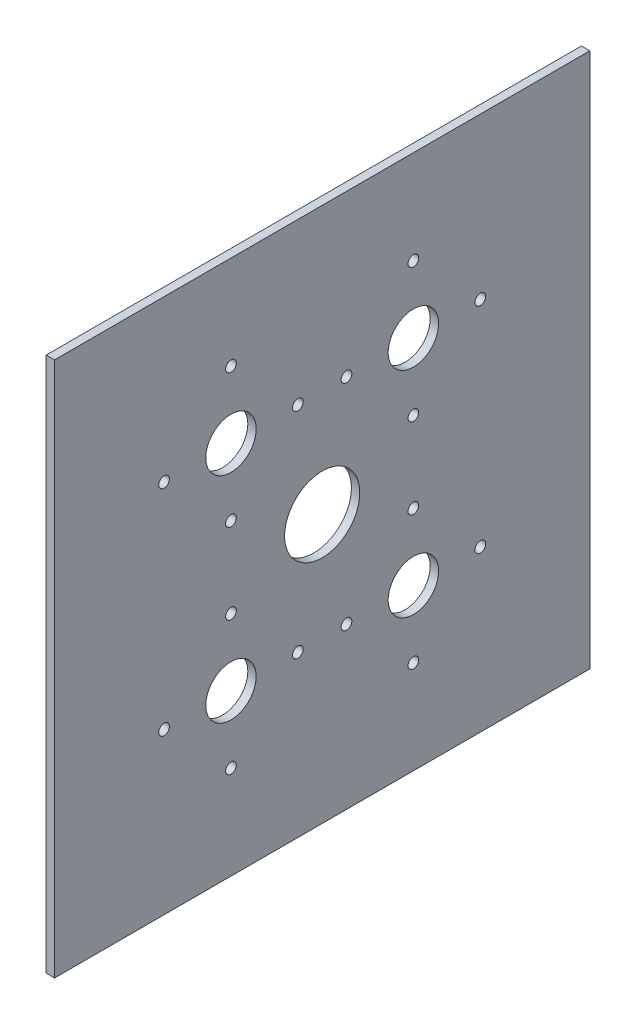
ISO-10303-21;
HEADER;
FILE_DESCRIPTION(('STEP AP214'),'2;1');
FILE_NAME('part.step','',(''),(''),'','','');
FILE_SCHEMA(('AUTOMOTIVE_DESIGN { 1 0 10303 214 1 1 1 1 }'));
ENDSEC;
DATA;
#1=APPLICATION_CONTEXT('core data for automotive mechanical design processes');
#2=APPLICATION_PROTOCOL_DEFINITION('international standard','automotive_design',2000,#1);
#3=PRODUCT_CONTEXT('',#1,'mechanical');
#4=PRODUCT('Part','Part','',(#3));
#5=PRODUCT_RELATED_PRODUCT_CATEGORY('part','',(#4));
#6=PRODUCT_DEFINITION_FORMATION('','',#4);
#7=PRODUCT_DEFINITION_CONTEXT('part definition',#1,'design');
#8=PRODUCT_DEFINITION('design','',#6,#7);
#9=PRODUCT_DEFINITION_SHAPE('','',#8);
#10=(LENGTH_UNIT() NAMED_UNIT(*) SI_UNIT(.MILLI.,.METRE.));
#11=(NAMED_UNIT(*) PLANE_ANGLE_UNIT() SI_UNIT($,.RADIAN.));
#12=(NAMED_UNIT(*) SI_UNIT($,.STERADIAN.) SOLID_ANGLE_UNIT());
#13=UNCERTAINTY_MEASURE_WITH_UNIT(LENGTH_MEASURE(1.E-05),#10,'distance_accuracy_value','');
#14=(GEOMETRIC_REPRESENTATION_CONTEXT(3) GLOBAL_UNCERTAINTY_ASSIGNED_CONTEXT((#13)) GLOBAL_UNIT_ASSIGNED_CONTEXT((#10,
#11,#12)) REPRESENTATION_CONTEXT('',''));
#15=CARTESIAN_POINT('',(0.,0.,0.));
#16=DIRECTION('',(0.,0.,1.));
#17=DIRECTION('',(1.,0.,0.));
#18=AXIS2_PLACEMENT_3D('',#15,#16,#17);
#19=CARTESIAN_POINT('',(-3.175,101.6,101.6));
#20=DIRECTION('',(0.,0.,1.));
#21=DIRECTION('',(0.,-1.,0.));
#22=AXIS2_PLACEMENT_3D('',#19,#20,#21);
#23=PLANE('',#22);
#24=DIRECTION('',(0.,-1.,0.));
#25=VECTOR('',#24,1.);
#26=CARTESIAN_POINT('',(0.,101.6,101.6));
#27=LINE('',#26,#25);
#28=CARTESIAN_POINT('',(0.,101.6,101.6));
#29=VERTEX_POINT('',#28);
#30=CARTESIAN_POINT('',(0.,-101.6,101.6));
#31=VERTEX_POINT('',#30);
#32=EDGE_CURVE('E111',#29,#31,#27,.T.);
#33=ORIENTED_EDGE('',*,*,#32,.F.);
#34=DIRECTION('',(1.,0.,0.));
#35=VECTOR('',#34,1.);
#36=CARTESIAN_POINT('',(-3.175,101.6,101.6));
#37=LINE('',#36,#35);
#38=CARTESIAN_POINT('',(-3.175,101.6,101.6));
#39=VERTEX_POINT('',#38);
#40=EDGE_CURVE('E11',#39,#29,#37,.T.);
#41=ORIENTED_EDGE('',*,*,#40,.F.);
#42=DIRECTION('',(0.,-1.,0.));
#43=VECTOR('',#42,1.);
#44=CARTESIAN_POINT('',(-3.175,101.6,101.6));
#45=LINE('',#44,#43);
#46=CARTESIAN_POINT('',(-3.175,-101.6,101.6));
#47=VERTEX_POINT('',#46);
#48=EDGE_CURVE('E102',#39,#47,#45,.T.);
#49=ORIENTED_EDGE('',*,*,#48,.T.);
#50=DIRECTION('',(1.,0.,0.));
#51=VECTOR('',#50,1.);
#52=CARTESIAN_POINT('',(-3.175,-101.6,101.6));
#53=LINE('',#52,#51);
#54=EDGE_CURVE('E46',#47,#31,#53,.T.);
#55=ORIENTED_EDGE('',*,*,#54,.T.);
#56=EDGE_LOOP('',(#33,#41,#49,#55));
#57=FACE_BOUND('',#56,.T.);
#58=ADVANCED_FACE('F43',(#57),#23,.T.);
#59=CARTESIAN_POINT('',(-3.175,101.6,-101.6));
#60=DIRECTION('',(0.,1.,0.));
#61=DIRECTION('',(0.,0.,1.));
#62=AXIS2_PLACEMENT_3D('',#59,#60,#61);
#63=PLANE('',#62);
#64=DIRECTION('',(0.,0.,1.));
#65=VECTOR('',#64,1.);
#66=CARTESIAN_POINT('',(0.,101.6,-101.6));
#67=LINE('',#66,#65);
#68=CARTESIAN_POINT('',(0.,101.6,-101.6));
#69=VERTEX_POINT('',#68);
#70=EDGE_CURVE('E106',#69,#29,#67,.T.);
#71=ORIENTED_EDGE('',*,*,#70,.F.);
#72=DIRECTION('',(1.,0.,0.));
#73=VECTOR('',#72,1.);
#74=CARTESIAN_POINT('',(-3.175,101.6,-101.6));
#75=LINE('',#74,#73);
#76=CARTESIAN_POINT('',(-3.175,101.6,-101.6));
#77=VERTEX_POINT('',#76);
#78=EDGE_CURVE('E52',#77,#69,#75,.T.);
#79=ORIENTED_EDGE('',*,*,#78,.F.);
#80=DIRECTION('',(0.,0.,1.));
#81=VECTOR('',#80,1.);
#82=CARTESIAN_POINT('',(-3.175,101.6,-101.6));
#83=LINE('',#82,#81);
#84=EDGE_CURVE('E98',#77,#39,#83,.T.);
#85=ORIENTED_EDGE('',*,*,#84,.T.);
#86=ORIENTED_EDGE('',*,*,#40,.T.);
#87=EDGE_LOOP('',(#71,#79,#85,#86));
#88=FACE_BOUND('',#87,.T.);
#89=ADVANCED_FACE('F122',(#88),#63,.T.);
#90=CARTESIAN_POINT('',(-3.175,101.6,-101.6));
#91=DIRECTION('',(0.,0.,-1.));
#92=DIRECTION('',(0.,1.,0.));
#93=AXIS2_PLACEMENT_3D('',#90,#91,#92);
#94=PLANE('',#93);
#95=DIRECTION('',(0.,1.,0.));
#96=VECTOR('',#95,1.);
#97=CARTESIAN_POINT('',(0.,101.6,-101.6));
#98=LINE('',#97,#96);
#99=CARTESIAN_POINT('',(0.,-101.6,-101.6));
#100=VERTEX_POINT('',#99);
#101=EDGE_CURVE('E93',#100,#69,#98,.T.);
#102=ORIENTED_EDGE('',*,*,#101,.F.);
#103=DIRECTION('',(1.,0.,0.));
#104=VECTOR('',#103,1.);
#105=CARTESIAN_POINT('',(-3.175,-101.6,-101.6));
#106=LINE('',#105,#104);
#107=CARTESIAN_POINT('',(-3.175,-101.6,-101.6));
#108=VERTEX_POINT('',#107);
#109=EDGE_CURVE('E88',#108,#100,#106,.T.);
#110=ORIENTED_EDGE('',*,*,#109,.F.);
#111=DIRECTION('',(0.,1.,0.));
#112=VECTOR('',#111,1.);
#113=CARTESIAN_POINT('',(-3.175,101.6,-101.6));
#114=LINE('',#113,#112);
#115=EDGE_CURVE('E91',#108,#77,#114,.T.);
#116=ORIENTED_EDGE('',*,*,#115,.T.);
#117=ORIENTED_EDGE('',*,*,#78,.T.);
#118=EDGE_LOOP('',(#102,#110,#116,#117));
#119=FACE_BOUND('',#118,.T.);
#120=ADVANCED_FACE('F90',(#119),#94,.T.);
#121=CARTESIAN_POINT('',(-3.175,-101.6,-101.6));
#122=DIRECTION('',(0.,-1.,0.));
#123=DIRECTION('',(0.,0.,-1.));
#124=AXIS2_PLACEMENT_3D('',#121,#122,#123);
#125=PLANE('',#124);
#126=DIRECTION('',(0.,0.,-1.));
#127=VECTOR('',#126,1.);
#128=CARTESIAN_POINT('',(0.,-101.6,-101.6));
#129=LINE('',#128,#127);
#130=EDGE_CURVE('E114',#31,#100,#129,.T.);
#131=ORIENTED_EDGE('',*,*,#130,.F.);
#132=ORIENTED_EDGE('',*,*,#54,.F.);
#133=DIRECTION('',(0.,0.,-1.));
#134=VECTOR('',#133,1.);
#135=CARTESIAN_POINT('',(-3.175,-101.6,-101.6));
#136=LINE('',#135,#134);
#137=EDGE_CURVE('E97',#47,#108,#136,.T.);
#138=ORIENTED_EDGE('',*,*,#137,.T.);
#139=ORIENTED_EDGE('',*,*,#109,.T.);
#140=EDGE_LOOP('',(#131,#132,#138,#139));
#141=FACE_BOUND('',#140,.T.);
#142=ADVANCED_FACE('F100',(#141),#125,.T.);
#143=CARTESIAN_POINT('',(-3.175,0.,0.));
#144=DIRECTION('',(-1.,0.,0.));
#145=DIRECTION('',(0.,0.,1.));
#146=AXIS2_PLACEMENT_3D('',#143,#144,#145);
#147=PLANE('',#146);
#148=CARTESIAN_POINT('',(-3.175,-15.2769774160487,-34.6218706995197));
#149=DIRECTION('',(1.,0.,0.));
#150=DIRECTION('',(0.,0.,-1.));
#151=AXIS2_PLACEMENT_3D('',#148,#149,#150);
#152=CIRCLE('',#151,2.032);
#153=CARTESIAN_POINT('',(-3.175,-15.2769774160487,-36.6538706995197));
#154=VERTEX_POINT('',#153);
#155=EDGE_CURVE('E274',#154,#154,#152,.T.);
#156=ORIENTED_EDGE('',*,*,#155,.T.);
#157=EDGE_LOOP('',(#156));
#158=FACE_BOUND('',#157,.T.);
#159=CARTESIAN_POINT('',(-3.175,-40.6769774160487,-60.0218706995198));
#160=DIRECTION('',(1.,0.,0.));
#161=DIRECTION('',(0.,0.,-1.));
#162=AXIS2_PLACEMENT_3D('',#159,#160,#161);
#163=CIRCLE('',#162,2.032);
#164=CARTESIAN_POINT('',(-3.175,-40.6769774160487,-62.0538706995197));
#165=VERTEX_POINT('',#164);
#166=EDGE_CURVE('E308',#165,#165,#163,.T.);
#167=ORIENTED_EDGE('',*,*,#166,.T.);
#168=EDGE_LOOP('',(#167));
#169=FACE_BOUND('',#168,.T.);
#170=CARTESIAN_POINT('',(-3.175,-66.0769774160487,-34.6218706995198));
#171=DIRECTION('',(1.,0.,0.));
#172=DIRECTION('',(0.,0.,-1.));
#173=AXIS2_PLACEMENT_3D('',#170,#171,#172);
#174=CIRCLE('',#173,2.032);
#175=CARTESIAN_POINT('',(-3.175,-66.0769774160487,-36.6538706995198));
#176=VERTEX_POINT('',#175);
#177=EDGE_CURVE('E289',#176,#176,#174,.T.);
#178=ORIENTED_EDGE('',*,*,#177,.T.);
#179=EDGE_LOOP('',(#178));
#180=FACE_BOUND('',#179,.T.);
#181=CARTESIAN_POINT('',(-3.175,-40.6769774160487,-9.22187069951976));
#182=DIRECTION('',(1.,0.,0.));
#183=DIRECTION('',(0.,0.,-1.));
#184=AXIS2_PLACEMENT_3D('',#181,#182,#183);
#185=CIRCLE('',#184,2.032);
#186=CARTESIAN_POINT('',(-3.175,-40.6769774160487,-11.2538706995198));
#187=VERTEX_POINT('',#186);
#188=EDGE_CURVE('E297',#187,#187,#185,.T.);
#189=ORIENTED_EDGE('',*,*,#188,.T.);
#190=EDGE_LOOP('',(#189));
#191=FACE_BOUND('',#190,.T.);
#192=CARTESIAN_POINT('',(-3.175,15.2769774160487,-34.6218706995197));
#193=DIRECTION('',(1.,0.,0.));
#194=DIRECTION('',(0.,0.,1.));
#195=AXIS2_PLACEMENT_3D('',#192,#193,#194);
#196=CIRCLE('',#195,2.032);
#197=CARTESIAN_POINT('',(-3.175,15.2769774160487,-32.5898706995198));
#198=VERTEX_POINT('',#197);
#199=EDGE_CURVE('E275',#198,#198,#196,.T.);
#200=ORIENTED_EDGE('',*,*,#199,.T.);
#201=EDGE_LOOP('',(#200));
#202=FACE_BOUND('',#201,.T.);
#203=CARTESIAN_POINT('',(-3.175,40.6769774160487,-60.0218706995198));
#204=DIRECTION('',(1.,0.,0.));
#205=DIRECTION('',(0.,0.,1.));
#206=AXIS2_PLACEMENT_3D('',#203,#204,#205);
#207=CIRCLE('',#206,2.032);
#208=CARTESIAN_POINT('',(-3.175,40.6769774160487,-57.9898706995198));
#209=VERTEX_POINT('',#208);
#210=EDGE_CURVE('E284',#209,#209,#207,.T.);
#211=ORIENTED_EDGE('',*,*,#210,.T.);
#212=EDGE_LOOP('',(#211));
#213=FACE_BOUND('',#212,.T.);
#214=CARTESIAN_POINT('',(-3.175,40.6769774160487,-9.22187069951976));
#215=DIRECTION('',(1.,0.,0.));
#216=DIRECTION('',(0.,0.,1.));
#217=AXIS2_PLACEMENT_3D('',#214,#215,#216);
#218=CIRCLE('',#217,2.032);
#219=CARTESIAN_POINT('',(-3.175,40.6769774160487,-7.18987069951976));
#220=VERTEX_POINT('',#219);
#221=EDGE_CURVE('E261',#220,#220,#218,.T.);
#222=ORIENTED_EDGE('',*,*,#221,.T.);
#223=EDGE_LOOP('',(#222));
#224=FACE_BOUND('',#223,.T.);
#225=CARTESIAN_POINT('',(-3.175,66.0769774160487,-34.6218706995198));
#226=DIRECTION('',(1.,0.,0.));
#227=DIRECTION('',(0.,0.,1.));
#228=AXIS2_PLACEMENT_3D('',#225,#226,#227);
#229=CIRCLE('',#228,2.032);
#230=CARTESIAN_POINT('',(-3.175,66.0769774160487,-32.5898706995198));
#231=VERTEX_POINT('',#230);
#232=EDGE_CURVE('E268',#231,#231,#229,.T.);
#233=ORIENTED_EDGE('',*,*,#232,.T.);
#234=EDGE_LOOP('',(#233));
#235=FACE_BOUND('',#234,.T.);
#236=CARTESIAN_POINT('',(-3.175,0.,0.));
#237=DIRECTION('',(1.,0.,0.));
#238=DIRECTION('',(0.,0.,-1.));
#239=AXIS2_PLACEMENT_3D('',#236,#237,#238);
#240=CIRCLE('',#239,14.2621);
#241=CARTESIAN_POINT('',(-3.175,0.,-14.2621));
#242=VERTEX_POINT('',#241);
#243=EDGE_CURVE('E350',#242,#242,#240,.T.);
#244=ORIENTED_EDGE('',*,*,#243,.T.);
#245=EDGE_LOOP('',(#244));
#246=FACE_BOUND('',#245,.T.);
#247=CARTESIAN_POINT('',(-3.175,-40.6769774160487,-34.6218706995197));
#248=DIRECTION('',(1.,0.,0.));
#249=DIRECTION('',(0.,0.,-1.));
#250=AXIS2_PLACEMENT_3D('',#247,#248,#249);
#251=CIRCLE('',#250,9.56310000000001);
#252=CARTESIAN_POINT('',(-3.175,-40.6769774160487,-44.1849706995198));
#253=VERTEX_POINT('',#252);
#254=EDGE_CURVE('E341',#253,#253,#251,.T.);
#255=ORIENTED_EDGE('',*,*,#254,.T.);
#256=EDGE_LOOP('',(#255));
#257=FACE_BOUND('',#256,.T.);
#258=CARTESIAN_POINT('',(-3.175,-40.6769774160487,34.6218706995197));
#259=DIRECTION('',(1.,0.,0.));
#260=DIRECTION('',(0.,0.,-1.));
#261=AXIS2_PLACEMENT_3D('',#258,#259,#260);
#262=CIRCLE('',#261,9.5631);
#263=CARTESIAN_POINT('',(-3.175,-40.6769774160487,25.0587706995197));
#264=VERTEX_POINT('',#263);
#265=EDGE_CURVE('E364',#264,#264,#262,.T.);
#266=ORIENTED_EDGE('',*,*,#265,.T.);
#267=EDGE_LOOP('',(#266));
#268=FACE_BOUND('',#267,.T.);
#269=CARTESIAN_POINT('',(-3.175,40.6769774160487,-34.6218706995197));
#270=DIRECTION('',(1.,0.,0.));
#271=DIRECTION('',(0.,0.,-1.));
#272=AXIS2_PLACEMENT_3D('',#269,#270,#271);
#273=CIRCLE('',#272,9.5631);
#274=CARTESIAN_POINT('',(-3.175,40.6769774160487,-44.1849706995197));
#275=VERTEX_POINT('',#274);
#276=EDGE_CURVE('E357',#275,#275,#273,.T.);
#277=ORIENTED_EDGE('',*,*,#276,.T.);
#278=EDGE_LOOP('',(#277));
#279=FACE_BOUND('',#278,.T.);
#280=CARTESIAN_POINT('',(-3.175,40.6769774160487,9.22187069951974));
#281=DIRECTION('',(1.,0.,0.));
#282=DIRECTION('',(0.,0.,-1.));
#283=AXIS2_PLACEMENT_3D('',#280,#281,#282);
#284=CIRCLE('',#283,2.032);
#285=CARTESIAN_POINT('',(-3.175,40.6769774160487,7.18987069951974));
#286=VERTEX_POINT('',#285);
#287=EDGE_CURVE('E322',#286,#286,#284,.T.);
#288=ORIENTED_EDGE('',*,*,#287,.T.);
#289=EDGE_LOOP('',(#288));
#290=FACE_BOUND('',#289,.T.);
#291=CARTESIAN_POINT('',(-3.175,66.0769774160487,34.6218706995197));
#292=DIRECTION('',(1.,0.,0.));
#293=DIRECTION('',(0.,0.,-1.));
#294=AXIS2_PLACEMENT_3D('',#291,#292,#293);
#295=CIRCLE('',#294,2.032);
#296=CARTESIAN_POINT('',(-3.175,66.0769774160487,32.5898706995197));
#297=VERTEX_POINT('',#296);
#298=EDGE_CURVE('E313',#297,#297,#295,.T.);
#299=ORIENTED_EDGE('',*,*,#298,.T.);
#300=EDGE_LOOP('',(#299));
#301=FACE_BOUND('',#300,.T.);
#302=CARTESIAN_POINT('',(-3.175,40.6769774160487,60.0218706995197));
#303=DIRECTION('',(1.,0.,0.));
#304=DIRECTION('',(0.,0.,-1.));
#305=AXIS2_PLACEMENT_3D('',#302,#303,#304);
#306=CIRCLE('',#305,2.032);
#307=CARTESIAN_POINT('',(-3.175,40.6769774160487,57.9898706995197));
#308=VERTEX_POINT('',#307);
#309=EDGE_CURVE('E334',#308,#308,#306,.T.);
#310=ORIENTED_EDGE('',*,*,#309,.T.);
#311=EDGE_LOOP('',(#310));
#312=FACE_BOUND('',#311,.T.);
#313=CARTESIAN_POINT('',(-3.175,15.2769774160487,34.6218706995197));
#314=DIRECTION('',(1.,0.,0.));
#315=DIRECTION('',(0.,0.,-1.));
#316=AXIS2_PLACEMENT_3D('',#313,#314,#315);
#317=CIRCLE('',#316,2.032);
#318=CARTESIAN_POINT('',(-3.175,15.2769774160487,32.5898706995197));
#319=VERTEX_POINT('',#318);
#320=EDGE_CURVE('E327',#319,#319,#317,.T.);
#321=ORIENTED_EDGE('',*,*,#320,.T.);
#322=EDGE_LOOP('',(#321));
#323=FACE_BOUND('',#322,.T.);
#324=CARTESIAN_POINT('',(-3.175,-66.0769774160487,34.6218706995197));
#325=DIRECTION('',(1.,0.,0.));
#326=DIRECTION('',(0.,0.,1.));
#327=AXIS2_PLACEMENT_3D('',#324,#325,#326);
#328=CIRCLE('',#327,2.032);
#329=CARTESIAN_POINT('',(-3.175,-66.0769774160487,36.6538706995197));
#330=VERTEX_POINT('',#329);
#331=EDGE_CURVE('E237',#330,#330,#328,.T.);
#332=ORIENTED_EDGE('',*,*,#331,.T.);
#333=EDGE_LOOP('',(#332));
#334=FACE_BOUND('',#333,.T.);
#335=CARTESIAN_POINT('',(-3.175,-40.6769774160487,60.0218706995197));
#336=DIRECTION('',(1.,0.,0.));
#337=DIRECTION('',(0.,0.,1.));
#338=AXIS2_PLACEMENT_3D('',#335,#336,#337);
#339=CIRCLE('',#338,2.032);
#340=CARTESIAN_POINT('',(-3.175,-40.6769774160487,62.0538706995197));
#341=VERTEX_POINT('',#340);
#342=EDGE_CURVE('E232',#341,#341,#339,.T.);
#343=ORIENTED_EDGE('',*,*,#342,.T.);
#344=EDGE_LOOP('',(#343));
#345=FACE_BOUND('',#344,.T.);
#346=CARTESIAN_POINT('',(-3.175,-15.2769774160487,34.6218706995197));
#347=DIRECTION('',(1.,0.,0.));
#348=DIRECTION('',(0.,0.,1.));
#349=AXIS2_PLACEMENT_3D('',#346,#347,#348);
#350=CIRCLE('',#349,2.032);
#351=CARTESIAN_POINT('',(-3.175,-15.2769774160487,36.6538706995197));
#352=VERTEX_POINT('',#351);
#353=EDGE_CURVE('E256',#352,#352,#350,.T.);
#354=ORIENTED_EDGE('',*,*,#353,.T.);
#355=EDGE_LOOP('',(#354));
#356=FACE_BOUND('',#355,.T.);
#357=CARTESIAN_POINT('',(-3.175,-40.6769774160487,9.22187069951974));
#358=DIRECTION('',(1.,0.,0.));
#359=DIRECTION('',(0.,0.,1.));
#360=AXIS2_PLACEMENT_3D('',#357,#358,#359);
#361=CIRCLE('',#360,2.032);
#362=CARTESIAN_POINT('',(-3.175,-40.6769774160487,11.2538706995197));
#363=VERTEX_POINT('',#362);
#364=EDGE_CURVE('E249',#363,#363,#361,.T.);
#365=ORIENTED_EDGE('',*,*,#364,.T.);
#366=EDGE_LOOP('',(#365));
#367=FACE_BOUND('',#366,.T.);
#368=CARTESIAN_POINT('',(-3.175,40.6769774160487,34.6218706995197));
#369=DIRECTION('',(1.,0.,0.));
#370=DIRECTION('',(0.,0.,-1.));
#371=AXIS2_PLACEMENT_3D('',#368,#369,#370);
#372=CIRCLE('',#371,9.5631);
#373=CARTESIAN_POINT('',(-3.175,40.6769774160487,25.0587706995197));
#374=VERTEX_POINT('',#373);
#375=EDGE_CURVE('E115',#374,#374,#372,.T.);
#376=ORIENTED_EDGE('',*,*,#375,.T.);
#377=EDGE_LOOP('',(#376));
#378=FACE_BOUND('',#377,.T.);
#379=ORIENTED_EDGE('',*,*,#48,.F.);
#380=ORIENTED_EDGE('',*,*,#84,.F.);
#381=ORIENTED_EDGE('',*,*,#115,.F.);
#382=ORIENTED_EDGE('',*,*,#137,.F.);
#383=EDGE_LOOP('',(#379,#380,#381,#382));
#384=FACE_BOUND('',#383,.T.);
#385=ADVANCED_FACE('F96',(#158,#169,#180,#191,#202,#213,#224,#235,#246,#257,#268,#279,#290,#301,
#312,#323,#334,#345,#356,#367,#378,#384),#147,.T.);
#386=CARTESIAN_POINT('',(0.,0.,0.));
#387=DIRECTION('',(-1.,0.,0.));
#388=DIRECTION('',(0.,0.,1.));
#389=AXIS2_PLACEMENT_3D('',#386,#387,#388);
#390=PLANE('',#389);
#391=CARTESIAN_POINT('',(0.,-15.2769774160487,-34.6218706995197));
#392=DIRECTION('',(1.,0.,0.));
#393=DIRECTION('',(0.,0.,-1.));
#394=AXIS2_PLACEMENT_3D('',#391,#392,#393);
#395=CIRCLE('',#394,2.032);
#396=CARTESIAN_POINT('',(0.,-15.2769774160487,-36.6538706995197));
#397=VERTEX_POINT('',#396);
#398=EDGE_CURVE('E304',#397,#397,#395,.T.);
#399=ORIENTED_EDGE('',*,*,#398,.F.);
#400=EDGE_LOOP('',(#399));
#401=FACE_BOUND('',#400,.T.);
#402=CARTESIAN_POINT('',(0.,-40.6769774160487,-60.0218706995198));
#403=DIRECTION('',(1.,0.,0.));
#404=DIRECTION('',(0.,0.,-1.));
#405=AXIS2_PLACEMENT_3D('',#402,#403,#404);
#406=CIRCLE('',#405,2.032);
#407=CARTESIAN_POINT('',(0.,-40.6769774160487,-62.0538706995197));
#408=VERTEX_POINT('',#407);
#409=EDGE_CURVE('E293',#408,#408,#406,.T.);
#410=ORIENTED_EDGE('',*,*,#409,.F.);
#411=EDGE_LOOP('',(#410));
#412=FACE_BOUND('',#411,.T.);
#413=CARTESIAN_POINT('',(0.,-66.0769774160487,-34.6218706995198));
#414=DIRECTION('',(1.,0.,0.));
#415=DIRECTION('',(0.,0.,-1.));
#416=AXIS2_PLACEMENT_3D('',#413,#414,#415);
#417=CIRCLE('',#416,2.032);
#418=CARTESIAN_POINT('',(0.,-66.0769774160487,-36.6538706995198));
#419=VERTEX_POINT('',#418);
#420=EDGE_CURVE('E294',#419,#419,#417,.T.);
#421=ORIENTED_EDGE('',*,*,#420,.F.);
#422=EDGE_LOOP('',(#421));
#423=FACE_BOUND('',#422,.T.);
#424=CARTESIAN_POINT('',(0.,-40.6769774160487,-9.22187069951976));
#425=DIRECTION('',(1.,0.,0.));
#426=DIRECTION('',(0.,0.,-1.));
#427=AXIS2_PLACEMENT_3D('',#424,#425,#426);
#428=CIRCLE('',#427,2.032);
#429=CARTESIAN_POINT('',(0.,-40.6769774160487,-11.2538706995198));
#430=VERTEX_POINT('',#429);
#431=EDGE_CURVE('E252',#430,#430,#428,.T.);
#432=ORIENTED_EDGE('',*,*,#431,.F.);
#433=EDGE_LOOP('',(#432));
#434=FACE_BOUND('',#433,.T.);
#435=CARTESIAN_POINT('',(0.,15.2769774160487,-34.6218706995197));
#436=DIRECTION('',(1.,0.,0.));
#437=DIRECTION('',(0.,0.,1.));
#438=AXIS2_PLACEMENT_3D('',#435,#436,#437);
#439=CIRCLE('',#438,2.032);
#440=CARTESIAN_POINT('',(0.,15.2769774160487,-32.5898706995198));
#441=VERTEX_POINT('',#440);
#442=EDGE_CURVE('E280',#441,#441,#439,.T.);
#443=ORIENTED_EDGE('',*,*,#442,.F.);
#444=EDGE_LOOP('',(#443));
#445=FACE_BOUND('',#444,.T.);
#446=CARTESIAN_POINT('',(0.,40.6769774160487,-60.0218706995198));
#447=DIRECTION('',(1.,0.,0.));
#448=DIRECTION('',(0.,0.,1.));
#449=AXIS2_PLACEMENT_3D('',#446,#447,#448);
#450=CIRCLE('',#449,2.032);
#451=CARTESIAN_POINT('',(0.,40.6769774160487,-57.9898706995198));
#452=VERTEX_POINT('',#451);
#453=EDGE_CURVE('E264',#452,#452,#450,.T.);
#454=ORIENTED_EDGE('',*,*,#453,.F.);
#455=EDGE_LOOP('',(#454));
#456=FACE_BOUND('',#455,.T.);
#457=CARTESIAN_POINT('',(0.,40.6769774160487,-9.22187069951976));
#458=DIRECTION('',(1.,0.,0.));
#459=DIRECTION('',(0.,0.,1.));
#460=AXIS2_PLACEMENT_3D('',#457,#458,#459);
#461=CIRCLE('',#460,2.032);
#462=CARTESIAN_POINT('',(0.,40.6769774160487,-7.18987069951976));
#463=VERTEX_POINT('',#462);
#464=EDGE_CURVE('E265',#463,#463,#461,.T.);
#465=ORIENTED_EDGE('',*,*,#464,.F.);
#466=EDGE_LOOP('',(#465));
#467=FACE_BOUND('',#466,.T.);
#468=CARTESIAN_POINT('',(0.,66.0769774160487,-34.6218706995198));
#469=DIRECTION('',(1.,0.,0.));
#470=DIRECTION('',(0.,0.,1.));
#471=AXIS2_PLACEMENT_3D('',#468,#469,#470);
#472=CIRCLE('',#471,2.032);
#473=CARTESIAN_POINT('',(0.,66.0769774160487,-32.5898706995198));
#474=VERTEX_POINT('',#473);
#475=EDGE_CURVE('E271',#474,#474,#472,.T.);
#476=ORIENTED_EDGE('',*,*,#475,.F.);
#477=EDGE_LOOP('',(#476));
#478=FACE_BOUND('',#477,.T.);
#479=CARTESIAN_POINT('',(0.,0.,0.));
#480=DIRECTION('',(1.,0.,0.));
#481=DIRECTION('',(0.,0.,-1.));
#482=AXIS2_PLACEMENT_3D('',#479,#480,#481);
#483=CIRCLE('',#482,14.2621);
#484=CARTESIAN_POINT('',(0.,0.,-14.2621));
#485=VERTEX_POINT('',#484);
#486=EDGE_CURVE('E330',#485,#485,#483,.T.);
#487=ORIENTED_EDGE('',*,*,#486,.F.);
#488=EDGE_LOOP('',(#487));
#489=FACE_BOUND('',#488,.T.);
#490=CARTESIAN_POINT('',(0.,-40.6769774160487,-34.6218706995197));
#491=DIRECTION('',(1.,0.,0.));
#492=DIRECTION('',(0.,0.,-1.));
#493=AXIS2_PLACEMENT_3D('',#490,#491,#492);
#494=CIRCLE('',#493,9.56310000000001);
#495=CARTESIAN_POINT('',(0.,-40.6769774160487,-44.1849706995198));
#496=VERTEX_POINT('',#495);
#497=EDGE_CURVE('E346',#496,#496,#494,.T.);
#498=ORIENTED_EDGE('',*,*,#497,.F.);
#499=EDGE_LOOP('',(#498));
#500=FACE_BOUND('',#499,.T.);
#501=CARTESIAN_POINT('',(0.,-40.6769774160487,34.6218706995197));
#502=DIRECTION('',(1.,0.,0.));
#503=DIRECTION('',(0.,0.,-1.));
#504=AXIS2_PLACEMENT_3D('',#501,#502,#503);
#505=CIRCLE('',#504,9.5631);
#506=CARTESIAN_POINT('',(0.,-40.6769774160487,25.0587706995197));
#507=VERTEX_POINT('',#506);
#508=EDGE_CURVE('E345',#507,#507,#505,.T.);
#509=ORIENTED_EDGE('',*,*,#508,.F.);
#510=EDGE_LOOP('',(#509));
#511=FACE_BOUND('',#510,.T.);
#512=CARTESIAN_POINT('',(0.,40.6769774160487,-34.6218706995197));
#513=DIRECTION('',(1.,0.,0.));
#514=DIRECTION('',(0.,0.,-1.));
#515=AXIS2_PLACEMENT_3D('',#512,#513,#514);
#516=CIRCLE('',#515,9.5631);
#517=CARTESIAN_POINT('',(0.,40.6769774160487,-44.1849706995197));
#518=VERTEX_POINT('',#517);
#519=EDGE_CURVE('E361',#518,#518,#516,.T.);
#520=ORIENTED_EDGE('',*,*,#519,.F.);
#521=EDGE_LOOP('',(#520));
#522=FACE_BOUND('',#521,.T.);
#523=CARTESIAN_POINT('',(0.,40.6769774160487,9.22187069951974));
#524=DIRECTION('',(1.,0.,0.));
#525=DIRECTION('',(0.,0.,-1.));
#526=AXIS2_PLACEMENT_3D('',#523,#524,#525);
#527=CIRCLE('',#526,2.032);
#528=CARTESIAN_POINT('',(0.,40.6769774160487,7.18987069951974));
#529=VERTEX_POINT('',#528);
#530=EDGE_CURVE('E279',#529,#529,#527,.T.);
#531=ORIENTED_EDGE('',*,*,#530,.F.);
#532=EDGE_LOOP('',(#531));
#533=FACE_BOUND('',#532,.T.);
#534=CARTESIAN_POINT('',(0.,66.0769774160487,34.6218706995197));
#535=DIRECTION('',(1.,0.,0.));
#536=DIRECTION('',(0.,0.,-1.));
#537=AXIS2_PLACEMENT_3D('',#534,#535,#536);
#538=CIRCLE('',#537,2.032);
#539=CARTESIAN_POINT('',(0.,66.0769774160487,32.5898706995197));
#540=VERTEX_POINT('',#539);
#541=EDGE_CURVE('E318',#540,#540,#538,.T.);
#542=ORIENTED_EDGE('',*,*,#541,.F.);
#543=EDGE_LOOP('',(#542));
#544=FACE_BOUND('',#543,.T.);
#545=CARTESIAN_POINT('',(0.,40.6769774160487,60.0218706995197));
#546=DIRECTION('',(1.,0.,0.));
#547=DIRECTION('',(0.,0.,-1.));
#548=AXIS2_PLACEMENT_3D('',#545,#546,#547);
#549=CIRCLE('',#548,2.032);
#550=CARTESIAN_POINT('',(0.,40.6769774160487,57.9898706995197));
#551=VERTEX_POINT('',#550);
#552=EDGE_CURVE('E317',#551,#551,#549,.T.);
#553=ORIENTED_EDGE('',*,*,#552,.F.);
#554=EDGE_LOOP('',(#553));
#555=FACE_BOUND('',#554,.T.);
#556=CARTESIAN_POINT('',(0.,15.2769774160487,34.6218706995197));
#557=DIRECTION('',(1.,0.,0.));
#558=DIRECTION('',(0.,0.,-1.));
#559=AXIS2_PLACEMENT_3D('',#556,#557,#558);
#560=CIRCLE('',#559,2.032);
#561=CARTESIAN_POINT('',(0.,15.2769774160487,32.5898706995197));
#562=VERTEX_POINT('',#561);
#563=EDGE_CURVE('E331',#562,#562,#560,.T.);
#564=ORIENTED_EDGE('',*,*,#563,.F.);
#565=EDGE_LOOP('',(#564));
#566=FACE_BOUND('',#565,.T.);
#567=CARTESIAN_POINT('',(0.,-66.0769774160487,34.6218706995197));
#568=DIRECTION('',(1.,0.,0.));
#569=DIRECTION('',(0.,0.,1.));
#570=AXIS2_PLACEMENT_3D('',#567,#568,#569);
#571=CIRCLE('',#570,2.032);
#572=CARTESIAN_POINT('',(0.,-66.0769774160487,36.6538706995197));
#573=VERTEX_POINT('',#572);
#574=EDGE_CURVE('E243',#573,#573,#571,.T.);
#575=ORIENTED_EDGE('',*,*,#574,.F.);
#576=EDGE_LOOP('',(#575));
#577=FACE_BOUND('',#576,.T.);
#578=CARTESIAN_POINT('',(0.,-40.6769774160487,60.0218706995197));
#579=DIRECTION('',(1.,0.,0.));
#580=DIRECTION('',(0.,0.,1.));
#581=AXIS2_PLACEMENT_3D('',#578,#579,#580);
#582=CIRCLE('',#581,2.032);
#583=CARTESIAN_POINT('',(0.,-40.6769774160487,62.0538706995197));
#584=VERTEX_POINT('',#583);
#585=EDGE_CURVE('E235',#584,#584,#582,.T.);
#586=ORIENTED_EDGE('',*,*,#585,.F.);
#587=EDGE_LOOP('',(#586));
#588=FACE_BOUND('',#587,.T.);
#589=CARTESIAN_POINT('',(0.,-15.2769774160487,34.6218706995197));
#590=DIRECTION('',(1.,0.,0.));
#591=DIRECTION('',(0.,0.,1.));
#592=AXIS2_PLACEMENT_3D('',#589,#590,#591);
#593=CIRCLE('',#592,2.032);
#594=CARTESIAN_POINT('',(0.,-15.2769774160487,36.6538706995197));
#595=VERTEX_POINT('',#594);
#596=EDGE_CURVE('E239',#595,#595,#593,.T.);
#597=ORIENTED_EDGE('',*,*,#596,.F.);
#598=EDGE_LOOP('',(#597));
#599=FACE_BOUND('',#598,.T.);
#600=CARTESIAN_POINT('',(0.,-40.6769774160487,9.22187069951974));
#601=DIRECTION('',(1.,0.,0.));
#602=DIRECTION('',(0.,0.,1.));
#603=AXIS2_PLACEMENT_3D('',#600,#601,#602);
#604=CIRCLE('',#603,2.032);
#605=CARTESIAN_POINT('',(0.,-40.6769774160487,11.2538706995197));
#606=VERTEX_POINT('',#605);
#607=EDGE_CURVE('E253',#606,#606,#604,.T.);
#608=ORIENTED_EDGE('',*,*,#607,.F.);
#609=EDGE_LOOP('',(#608));
#610=FACE_BOUND('',#609,.T.);
#611=CARTESIAN_POINT('',(0.,40.6769774160487,34.6218706995197));
#612=DIRECTION('',(1.,0.,0.));
#613=DIRECTION('',(0.,0.,-1.));
#614=AXIS2_PLACEMENT_3D('',#611,#612,#613);
#615=CIRCLE('',#614,9.5631);
#616=CARTESIAN_POINT('',(0.,40.6769774160487,25.0587706995197));
#617=VERTEX_POINT('',#616);
#618=EDGE_CURVE('E360',#617,#617,#615,.T.);
#619=ORIENTED_EDGE('',*,*,#618,.F.);
#620=EDGE_LOOP('',(#619));
#621=FACE_BOUND('',#620,.T.);
#622=ORIENTED_EDGE('',*,*,#32,.T.);
#623=ORIENTED_EDGE('',*,*,#130,.T.);
#624=ORIENTED_EDGE('',*,*,#101,.T.);
#625=ORIENTED_EDGE('',*,*,#70,.T.);
#626=EDGE_LOOP('',(#622,#623,#624,#625));
#627=FACE_BOUND('',#626,.T.);
#628=ADVANCED_FACE('F121',(#401,#412,#423,#434,#445,#456,#467,#478,#489,#500,#511,#522,#533,
#544,#555,#566,#577,#588,#599,#610,#621,#627),#390,.F.);
#629=CARTESIAN_POINT('',(-3.175,40.6769774160487,34.6218706995197));
#630=DIRECTION('',(1.,0.,0.));
#631=DIRECTION('',(0.,0.,-1.));
#632=AXIS2_PLACEMENT_3D('',#629,#630,#631);
#633=CYLINDRICAL_SURFACE('',#632,9.5631);
#634=ORIENTED_EDGE('',*,*,#375,.F.);
#635=EDGE_LOOP('',(#634));
#636=FACE_BOUND('',#635,.T.);
#637=ORIENTED_EDGE('',*,*,#618,.T.);
#638=EDGE_LOOP('',(#637));
#639=FACE_BOUND('',#638,.T.);
#640=ADVANCED_FACE('F140',(#636,#639),#633,.F.);
#641=CARTESIAN_POINT('',(-3.175,-40.6769774160487,9.22187069951974));
#642=DIRECTION('',(1.,0.,0.));
#643=DIRECTION('',(0.,0.,-1.));
#644=AXIS2_PLACEMENT_3D('',#641,#642,#643);
#645=CYLINDRICAL_SURFACE('',#644,2.032);
#646=ORIENTED_EDGE('',*,*,#364,.F.);
#647=EDGE_LOOP('',(#646));
#648=FACE_BOUND('',#647,.T.);
#649=ORIENTED_EDGE('',*,*,#607,.T.);
#650=EDGE_LOOP('',(#649));
#651=FACE_BOUND('',#650,.T.);
#652=ADVANCED_FACE('F147',(#648,#651),#645,.F.);
#653=CARTESIAN_POINT('',(-3.175,-15.2769774160487,34.6218706995197));
#654=DIRECTION('',(1.,0.,0.));
#655=DIRECTION('',(0.,0.,-1.));
#656=AXIS2_PLACEMENT_3D('',#653,#654,#655);
#657=CYLINDRICAL_SURFACE('',#656,2.032);
#658=ORIENTED_EDGE('',*,*,#353,.F.);
#659=EDGE_LOOP('',(#658));
#660=FACE_BOUND('',#659,.T.);
#661=ORIENTED_EDGE('',*,*,#596,.T.);
#662=EDGE_LOOP('',(#661));
#663=FACE_BOUND('',#662,.T.);
#664=ADVANCED_FACE('F214',(#660,#663),#657,.F.);
#665=CARTESIAN_POINT('',(-3.175,-40.6769774160487,60.0218706995197));
#666=DIRECTION('',(1.,0.,0.));
#667=DIRECTION('',(0.,0.,-1.));
#668=AXIS2_PLACEMENT_3D('',#665,#666,#667);
#669=CYLINDRICAL_SURFACE('',#668,2.032);
#670=ORIENTED_EDGE('',*,*,#342,.F.);
#671=EDGE_LOOP('',(#670));
#672=FACE_BOUND('',#671,.T.);
#673=ORIENTED_EDGE('',*,*,#585,.T.);
#674=EDGE_LOOP('',(#673));
#675=FACE_BOUND('',#674,.T.);
#676=ADVANCED_FACE('F217',(#672,#675),#669,.F.);
#677=CARTESIAN_POINT('',(-3.175,-66.0769774160487,34.6218706995197));
#678=DIRECTION('',(1.,0.,0.));
#679=DIRECTION('',(0.,0.,-1.));
#680=AXIS2_PLACEMENT_3D('',#677,#678,#679);
#681=CYLINDRICAL_SURFACE('',#680,2.032);
#682=ORIENTED_EDGE('',*,*,#331,.F.);
#683=EDGE_LOOP('',(#682));
#684=FACE_BOUND('',#683,.T.);
#685=ORIENTED_EDGE('',*,*,#574,.T.);
#686=EDGE_LOOP('',(#685));
#687=FACE_BOUND('',#686,.T.);
#688=ADVANCED_FACE('F175',(#684,#687),#681,.F.);
#689=CARTESIAN_POINT('',(-3.175,15.2769774160487,34.6218706995197));
#690=DIRECTION('',(1.,0.,0.));
#691=DIRECTION('',(0.,0.,-1.));
#692=AXIS2_PLACEMENT_3D('',#689,#690,#691);
#693=CYLINDRICAL_SURFACE('',#692,2.032);
#694=ORIENTED_EDGE('',*,*,#320,.F.);
#695=EDGE_LOOP('',(#694));
#696=FACE_BOUND('',#695,.T.);
#697=ORIENTED_EDGE('',*,*,#563,.T.);
#698=EDGE_LOOP('',(#697));
#699=FACE_BOUND('',#698,.T.);
#700=ADVANCED_FACE('F171',(#696,#699),#693,.F.);
#701=CARTESIAN_POINT('',(-3.175,40.6769774160487,60.0218706995197));
#702=DIRECTION('',(1.,0.,0.));
#703=DIRECTION('',(0.,0.,-1.));
#704=AXIS2_PLACEMENT_3D('',#701,#702,#703);
#705=CYLINDRICAL_SURFACE('',#704,2.032);
#706=ORIENTED_EDGE('',*,*,#309,.F.);
#707=EDGE_LOOP('',(#706));
#708=FACE_BOUND('',#707,.T.);
#709=ORIENTED_EDGE('',*,*,#552,.T.);
#710=EDGE_LOOP('',(#709));
#711=FACE_BOUND('',#710,.T.);
#712=ADVANCED_FACE('F167',(#708,#711),#705,.F.);
#713=CARTESIAN_POINT('',(-3.175,66.0769774160487,34.6218706995197));
#714=DIRECTION('',(1.,0.,0.));
#715=DIRECTION('',(0.,0.,-1.));
#716=AXIS2_PLACEMENT_3D('',#713,#714,#715);
#717=CYLINDRICAL_SURFACE('',#716,2.032);
#718=ORIENTED_EDGE('',*,*,#298,.F.);
#719=EDGE_LOOP('',(#718));
#720=FACE_BOUND('',#719,.T.);
#721=ORIENTED_EDGE('',*,*,#541,.T.);
#722=EDGE_LOOP('',(#721));
#723=FACE_BOUND('',#722,.T.);
#724=ADVANCED_FACE('F170',(#720,#723),#717,.F.);
#725=CARTESIAN_POINT('',(-3.175,40.6769774160487,9.22187069951974));
#726=DIRECTION('',(1.,0.,0.));
#727=DIRECTION('',(0.,0.,-1.));
#728=AXIS2_PLACEMENT_3D('',#725,#726,#727);
#729=CYLINDRICAL_SURFACE('',#728,2.032);
#730=ORIENTED_EDGE('',*,*,#287,.F.);
#731=EDGE_LOOP('',(#730));
#732=FACE_BOUND('',#731,.T.);
#733=ORIENTED_EDGE('',*,*,#530,.T.);
#734=EDGE_LOOP('',(#733));
#735=FACE_BOUND('',#734,.T.);
#736=ADVANCED_FACE('F157',(#732,#735),#729,.F.);
#737=CARTESIAN_POINT('',(-3.175,40.6769774160487,-34.6218706995197));
#738=DIRECTION('',(1.,0.,0.));
#739=DIRECTION('',(0.,0.,-1.));
#740=AXIS2_PLACEMENT_3D('',#737,#738,#739);
#741=CYLINDRICAL_SURFACE('',#740,9.5631);
#742=ORIENTED_EDGE('',*,*,#276,.F.);
#743=EDGE_LOOP('',(#742));
#744=FACE_BOUND('',#743,.T.);
#745=ORIENTED_EDGE('',*,*,#519,.T.);
#746=EDGE_LOOP('',(#745));
#747=FACE_BOUND('',#746,.T.);
#748=ADVANCED_FACE('F153',(#744,#747),#741,.F.);
#749=CARTESIAN_POINT('',(-3.175,-40.6769774160487,34.6218706995197));
#750=DIRECTION('',(1.,0.,0.));
#751=DIRECTION('',(0.,0.,-1.));
#752=AXIS2_PLACEMENT_3D('',#749,#750,#751);
#753=CYLINDRICAL_SURFACE('',#752,9.5631);
#754=ORIENTED_EDGE('',*,*,#265,.F.);
#755=EDGE_LOOP('',(#754));
#756=FACE_BOUND('',#755,.T.);
#757=ORIENTED_EDGE('',*,*,#508,.T.);
#758=EDGE_LOOP('',(#757));
#759=FACE_BOUND('',#758,.T.);
#760=ADVANCED_FACE('F149',(#756,#759),#753,.F.);
#761=CARTESIAN_POINT('',(-3.175,-40.6769774160487,-34.6218706995197));
#762=DIRECTION('',(1.,0.,0.));
#763=DIRECTION('',(0.,0.,-1.));
#764=AXIS2_PLACEMENT_3D('',#761,#762,#763);
#765=CYLINDRICAL_SURFACE('',#764,9.56310000000001);
#766=ORIENTED_EDGE('',*,*,#254,.F.);
#767=EDGE_LOOP('',(#766));
#768=FACE_BOUND('',#767,.T.);
#769=ORIENTED_EDGE('',*,*,#497,.T.);
#770=EDGE_LOOP('',(#769));
#771=FACE_BOUND('',#770,.T.);
#772=ADVANCED_FACE('F152',(#768,#771),#765,.F.);
#773=CARTESIAN_POINT('',(-3.175,0.,0.));
#774=DIRECTION('',(1.,0.,0.));
#775=DIRECTION('',(0.,0.,-1.));
#776=AXIS2_PLACEMENT_3D('',#773,#774,#775);
#777=CYLINDRICAL_SURFACE('',#776,14.2621);
#778=ORIENTED_EDGE('',*,*,#243,.F.);
#779=EDGE_LOOP('',(#778));
#780=FACE_BOUND('',#779,.T.);
#781=ORIENTED_EDGE('',*,*,#486,.T.);
#782=EDGE_LOOP('',(#781));
#783=FACE_BOUND('',#782,.T.);
#784=ADVANCED_FACE('F159',(#780,#783),#777,.F.);
#785=CARTESIAN_POINT('',(-3.175,66.0769774160487,-34.6218706995198));
#786=DIRECTION('',(1.,0.,0.));
#787=DIRECTION('',(0.,0.,-1.));
#788=AXIS2_PLACEMENT_3D('',#785,#786,#787);
#789=CYLINDRICAL_SURFACE('',#788,2.032);
#790=ORIENTED_EDGE('',*,*,#232,.F.);
#791=EDGE_LOOP('',(#790));
#792=FACE_BOUND('',#791,.T.);
#793=ORIENTED_EDGE('',*,*,#475,.T.);
#794=EDGE_LOOP('',(#793));
#795=FACE_BOUND('',#794,.T.);
#796=ADVANCED_FACE('F162',(#792,#795),#789,.F.);
#797=CARTESIAN_POINT('',(-3.175,40.6769774160487,-9.22187069951976));
#798=DIRECTION('',(1.,0.,0.));
#799=DIRECTION('',(0.,0.,-1.));
#800=AXIS2_PLACEMENT_3D('',#797,#798,#799);
#801=CYLINDRICAL_SURFACE('',#800,2.032);
#802=ORIENTED_EDGE('',*,*,#221,.F.);
#803=EDGE_LOOP('',(#802));
#804=FACE_BOUND('',#803,.T.);
#805=ORIENTED_EDGE('',*,*,#464,.T.);
#806=EDGE_LOOP('',(#805));
#807=FACE_BOUND('',#806,.T.);
#808=ADVANCED_FACE('F203',(#804,#807),#801,.F.);
#809=CARTESIAN_POINT('',(-3.175,40.6769774160487,-60.0218706995198));
#810=DIRECTION('',(1.,0.,0.));
#811=DIRECTION('',(0.,0.,-1.));
#812=AXIS2_PLACEMENT_3D('',#809,#810,#811);
#813=CYLINDRICAL_SURFACE('',#812,2.032);
#814=ORIENTED_EDGE('',*,*,#210,.F.);
#815=EDGE_LOOP('',(#814));
#816=FACE_BOUND('',#815,.T.);
#817=ORIENTED_EDGE('',*,*,#453,.T.);
#818=EDGE_LOOP('',(#817));
#819=FACE_BOUND('',#818,.T.);
#820=ADVANCED_FACE('F200',(#816,#819),#813,.F.);
#821=CARTESIAN_POINT('',(-3.175,15.2769774160487,-34.6218706995197));
#822=DIRECTION('',(1.,0.,0.));
#823=DIRECTION('',(0.,0.,-1.));
#824=AXIS2_PLACEMENT_3D('',#821,#822,#823);
#825=CYLINDRICAL_SURFACE('',#824,2.032);
#826=ORIENTED_EDGE('',*,*,#199,.F.);
#827=EDGE_LOOP('',(#826));
#828=FACE_BOUND('',#827,.T.);
#829=ORIENTED_EDGE('',*,*,#442,.T.);
#830=EDGE_LOOP('',(#829));
#831=FACE_BOUND('',#830,.T.);
#832=ADVANCED_FACE('F195',(#828,#831),#825,.F.);
#833=CARTESIAN_POINT('',(-3.175,-40.6769774160487,-9.22187069951976));
#834=DIRECTION('',(1.,0.,0.));
#835=DIRECTION('',(0.,0.,-1.));
#836=AXIS2_PLACEMENT_3D('',#833,#834,#835);
#837=CYLINDRICAL_SURFACE('',#836,2.032);
#838=ORIENTED_EDGE('',*,*,#188,.F.);
#839=EDGE_LOOP('',(#838));
#840=FACE_BOUND('',#839,.T.);
#841=ORIENTED_EDGE('',*,*,#431,.T.);
#842=EDGE_LOOP('',(#841));
#843=FACE_BOUND('',#842,.T.);
#844=ADVANCED_FACE('F192',(#840,#843),#837,.F.);
#845=CARTESIAN_POINT('',(-3.175,-66.0769774160487,-34.6218706995198));
#846=DIRECTION('',(1.,0.,0.));
#847=DIRECTION('',(0.,0.,-1.));
#848=AXIS2_PLACEMENT_3D('',#845,#846,#847);
#849=CYLINDRICAL_SURFACE('',#848,2.032);
#850=ORIENTED_EDGE('',*,*,#177,.F.);
#851=EDGE_LOOP('',(#850));
#852=FACE_BOUND('',#851,.T.);
#853=ORIENTED_EDGE('',*,*,#420,.T.);
#854=EDGE_LOOP('',(#853));
#855=FACE_BOUND('',#854,.T.);
#856=ADVANCED_FACE('F187',(#852,#855),#849,.F.);
#857=CARTESIAN_POINT('',(-3.175,-40.6769774160487,-60.0218706995198));
#858=DIRECTION('',(1.,0.,0.));
#859=DIRECTION('',(0.,0.,-1.));
#860=AXIS2_PLACEMENT_3D('',#857,#858,#859);
#861=CYLINDRICAL_SURFACE('',#860,2.032);
#862=ORIENTED_EDGE('',*,*,#166,.F.);
#863=EDGE_LOOP('',(#862));
#864=FACE_BOUND('',#863,.T.);
#865=ORIENTED_EDGE('',*,*,#409,.T.);
#866=EDGE_LOOP('',(#865));
#867=FACE_BOUND('',#866,.T.);
#868=ADVANCED_FACE('F183',(#864,#867),#861,.F.);
#869=CARTESIAN_POINT('',(-3.175,-15.2769774160487,-34.6218706995197));
#870=DIRECTION('',(1.,0.,0.));
#871=DIRECTION('',(0.,0.,-1.));
#872=AXIS2_PLACEMENT_3D('',#869,#870,#871);
#873=CYLINDRICAL_SURFACE('',#872,2.032);
#874=ORIENTED_EDGE('',*,*,#155,.F.);
#875=EDGE_LOOP('',(#874));
#876=FACE_BOUND('',#875,.T.);
#877=ORIENTED_EDGE('',*,*,#398,.T.);
#878=EDGE_LOOP('',(#877));
#879=FACE_BOUND('',#878,.T.);
#880=ADVANCED_FACE('F186',(#876,#879),#873,.F.);
#881=CLOSED_SHELL('',(#58,#89,#120,#142,#385,#628,#640,#652,#664,#676,#688,#700,#712,#724,#736,
#748,#760,#772,#784,#796,#808,#820,#832,#844,#856,#868,#880));
#882=MANIFOLD_SOLID_BREP('B2',#881);
#883=ADVANCED_BREP_SHAPE_REPRESENTATION('',(#18,#882),#14);
#884=SHAPE_DEFINITION_REPRESENTATION(#9,#883);
ENDSEC;
END-ISO-10303-21;
